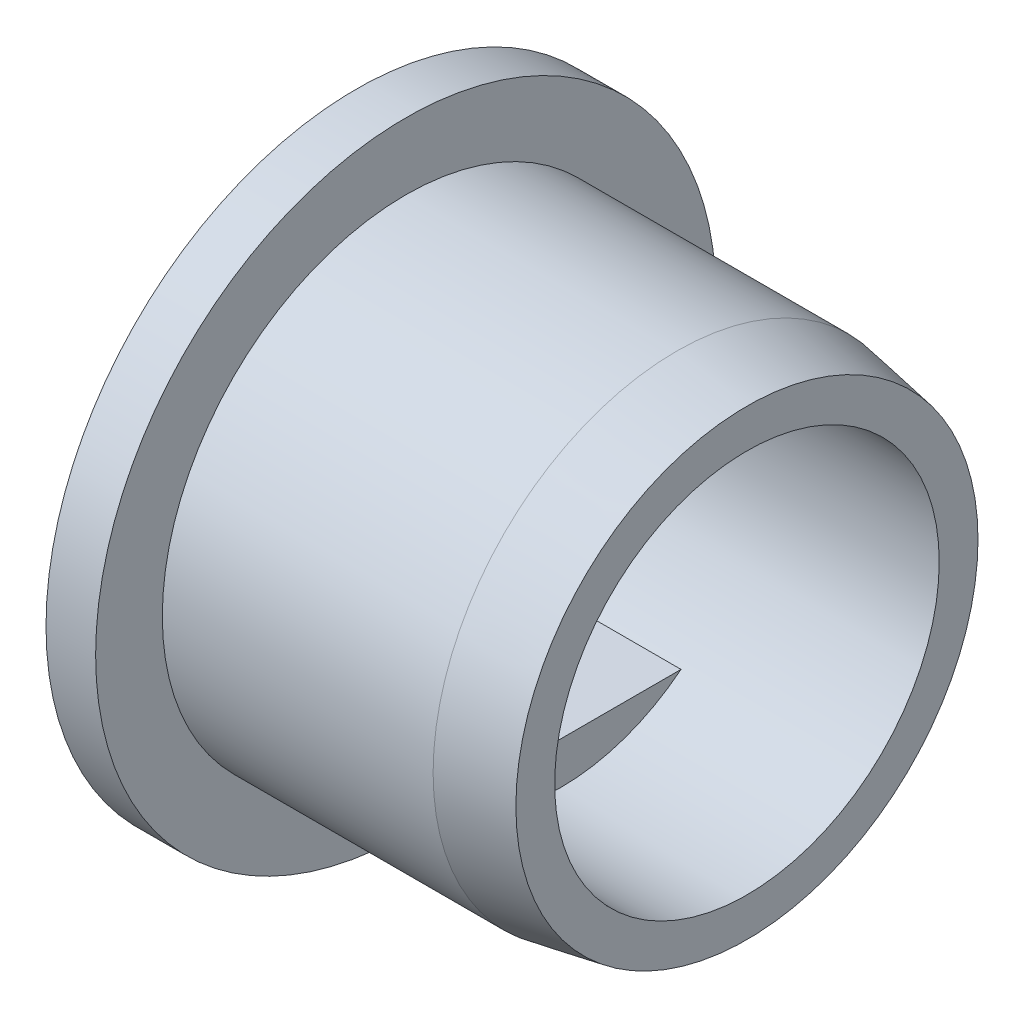
ISO-10303-21;
HEADER;
FILE_DESCRIPTION(('STEP AP214'),'2;1');
FILE_NAME('part.step','',(''),(''),'','','');
FILE_SCHEMA(('AUTOMOTIVE_DESIGN { 1 0 10303 214 1 1 1 1 }'));
ENDSEC;
DATA;
#1=APPLICATION_CONTEXT('core data for automotive mechanical design processes');
#2=APPLICATION_PROTOCOL_DEFINITION('international standard','automotive_design',2000,#1);
#3=PRODUCT_CONTEXT('',#1,'mechanical');
#4=PRODUCT('Part','Part','',(#3));
#5=PRODUCT_RELATED_PRODUCT_CATEGORY('part','',(#4));
#6=PRODUCT_DEFINITION_FORMATION('','',#4);
#7=PRODUCT_DEFINITION_CONTEXT('part definition',#1,'design');
#8=PRODUCT_DEFINITION('design','',#6,#7);
#9=PRODUCT_DEFINITION_SHAPE('','',#8);
#10=(LENGTH_UNIT() NAMED_UNIT(*) SI_UNIT(.MILLI.,.METRE.));
#11=(NAMED_UNIT(*) PLANE_ANGLE_UNIT() SI_UNIT($,.RADIAN.));
#12=(NAMED_UNIT(*) SI_UNIT($,.STERADIAN.) SOLID_ANGLE_UNIT());
#13=UNCERTAINTY_MEASURE_WITH_UNIT(LENGTH_MEASURE(1.E-05),#10,'distance_accuracy_value','');
#14=(GEOMETRIC_REPRESENTATION_CONTEXT(3) GLOBAL_UNCERTAINTY_ASSIGNED_CONTEXT((#13)) GLOBAL_UNIT_ASSIGNED_CONTEXT((#10,
#11,#12)) REPRESENTATION_CONTEXT('',''));
#15=CARTESIAN_POINT('',(0.,0.,0.));
#16=DIRECTION('',(0.,0.,1.));
#17=DIRECTION('',(1.,0.,0.));
#18=AXIS2_PLACEMENT_3D('',#15,#16,#17);
#19=CARTESIAN_POINT('',(150.8,0.,0.));
#20=DIRECTION('',(1.,0.,0.));
#21=DIRECTION('',(0.,0.,-1.));
#22=AXIS2_PLACEMENT_3D('',#19,#20,#21);
#23=PLANE('',#22);
#24=CARTESIAN_POINT('',(150.8,0.,0.));
#25=DIRECTION('',(1.,0.,0.));
#26=DIRECTION('',(0.,0.,-1.));
#27=AXIS2_PLACEMENT_3D('',#24,#25,#26);
#28=CIRCLE('',#27,3.925);
#29=CARTESIAN_POINT('',(150.8,0.,-3.925));
#30=VERTEX_POINT('',#29);
#31=EDGE_CURVE('E81',#30,#30,#28,.T.);
#32=ORIENTED_EDGE('',*,*,#31,.F.);
#33=EDGE_LOOP('',(#32));
#34=FACE_BOUND('',#33,.T.);
#35=CARTESIAN_POINT('',(150.8,0.,0.));
#36=DIRECTION('',(1.,0.,0.));
#37=DIRECTION('',(0.,0.,-1.));
#38=AXIS2_PLACEMENT_3D('',#35,#36,#37);
#39=CIRCLE('',#38,5.);
#40=CARTESIAN_POINT('',(150.8,0.,-5.));
#41=VERTEX_POINT('',#40);
#42=EDGE_CURVE('E132',#41,#41,#39,.T.);
#43=ORIENTED_EDGE('',*,*,#42,.T.);
#44=EDGE_LOOP('',(#43));
#45=FACE_BOUND('',#44,.T.);
#46=ADVANCED_FACE('F38',(#34,#45),#23,.T.);
#47=CARTESIAN_POINT('',(150.,0.,0.));
#48=DIRECTION('',(1.,0.,0.));
#49=DIRECTION('',(0.,0.,-1.));
#50=AXIS2_PLACEMENT_3D('',#47,#48,#49);
#51=PLANE('',#50);
#52=DIRECTION('',(0.,0.,-1.));
#53=VECTOR('',#52,1.);
#54=CARTESIAN_POINT('',(150.,-2.42,0.));
#55=LINE('',#54,#53);
#56=CARTESIAN_POINT('',(150.,-2.42,1.93742096612997));
#57=VERTEX_POINT('',#56);
#58=CARTESIAN_POINT('',(150.,-2.42,-1.93742096612997));
#59=VERTEX_POINT('',#58);
#60=EDGE_CURVE('E53',#57,#59,#55,.T.);
#61=ORIENTED_EDGE('',*,*,#60,.T.);
#62=CARTESIAN_POINT('',(150.,0.,0.));
#63=DIRECTION('',(1.,0.,0.));
#64=DIRECTION('',(0.,0.,-1.));
#65=AXIS2_PLACEMENT_3D('',#62,#63,#64);
#66=CIRCLE('',#65,3.1);
#67=EDGE_CURVE('E66',#57,#59,#66,.F.);
#68=ORIENTED_EDGE('',*,*,#67,.F.);
#69=EDGE_LOOP('',(#61,#68));
#70=FACE_BOUND('',#69,.T.);
#71=CARTESIAN_POINT('',(150.,0.,0.));
#72=DIRECTION('',(1.,0.,0.));
#73=DIRECTION('',(0.,0.,-1.));
#74=AXIS2_PLACEMENT_3D('',#71,#72,#73);
#75=CIRCLE('',#74,5.);
#76=CARTESIAN_POINT('',(150.,0.,-5.));
#77=VERTEX_POINT('',#76);
#78=EDGE_CURVE('E42',#77,#77,#75,.T.);
#79=ORIENTED_EDGE('',*,*,#78,.F.);
#80=EDGE_LOOP('',(#79));
#81=FACE_BOUND('',#80,.T.);
#82=ADVANCED_FACE('F67',(#70,#81),#51,.F.);
#83=CARTESIAN_POINT('',(136.3,-2.42,0.));
#84=DIRECTION('',(0.,1.,0.));
#85=DIRECTION('',(0.,0.,1.));
#86=AXIS2_PLACEMENT_3D('',#83,#84,#85);
#87=PLANE('',#86);
#88=ORIENTED_EDGE('',*,*,#60,.F.);
#89=DIRECTION('',(1.,0.,0.));
#90=VECTOR('',#89,1.);
#91=CARTESIAN_POINT('',(136.3,-2.42,1.93742096612997));
#92=LINE('',#91,#90);
#93=CARTESIAN_POINT('',(153.3,-2.42,1.93742096612997));
#94=VERTEX_POINT('',#93);
#95=EDGE_CURVE('E74',#57,#94,#92,.T.);
#96=ORIENTED_EDGE('',*,*,#95,.T.);
#97=DIRECTION('',(0.,0.,1.));
#98=VECTOR('',#97,1.);
#99=CARTESIAN_POINT('',(153.3,-2.42,0.));
#100=LINE('',#99,#98);
#101=CARTESIAN_POINT('',(153.3,-2.42,-1.93742096612997));
#102=VERTEX_POINT('',#101);
#103=EDGE_CURVE('E84',#102,#94,#100,.T.);
#104=ORIENTED_EDGE('',*,*,#103,.F.);
#105=DIRECTION('',(1.,0.,0.));
#106=VECTOR('',#105,1.);
#107=CARTESIAN_POINT('',(136.3,-2.42,-1.93742096612997));
#108=LINE('',#107,#106);
#109=EDGE_CURVE('E60',#59,#102,#108,.T.);
#110=ORIENTED_EDGE('',*,*,#109,.F.);
#111=EDGE_LOOP('',(#88,#96,#104,#110));
#112=FACE_BOUND('',#111,.T.);
#113=ADVANCED_FACE('F72',(#112),#87,.T.);
#114=CARTESIAN_POINT('',(153.3,0.,0.));
#115=DIRECTION('',(1.,0.,0.));
#116=DIRECTION('',(0.,0.,-1.));
#117=AXIS2_PLACEMENT_3D('',#114,#115,#116);
#118=PLANE('',#117);
#119=CARTESIAN_POINT('',(153.3,0.,0.));
#120=DIRECTION('',(1.,0.,0.));
#121=DIRECTION('',(0.,0.,-1.));
#122=AXIS2_PLACEMENT_3D('',#119,#120,#121);
#123=CIRCLE('',#122,3.1);
#124=EDGE_CURVE('E75',#94,#102,#123,.T.);
#125=ORIENTED_EDGE('',*,*,#124,.T.);
#126=ORIENTED_EDGE('',*,*,#103,.T.);
#127=EDGE_LOOP('',(#125,#126));
#128=FACE_BOUND('',#127,.T.);
#129=ADVANCED_FACE('F121',(#128),#118,.T.);
#130=CARTESIAN_POINT('',(136.3,0.,0.));
#131=DIRECTION('',(1.,0.,0.));
#132=DIRECTION('',(0.,0.,-1.));
#133=AXIS2_PLACEMENT_3D('',#130,#131,#132);
#134=CYLINDRICAL_SURFACE('',#133,3.1);
#135=CARTESIAN_POINT('',(156.3,0.,0.));
#136=DIRECTION('',(1.,0.,0.));
#137=DIRECTION('',(0.,0.,-1.));
#138=AXIS2_PLACEMENT_3D('',#135,#136,#137);
#139=CIRCLE('',#138,3.1);
#140=CARTESIAN_POINT('',(156.3,0.,-3.1));
#141=VERTEX_POINT('',#140);
#142=EDGE_CURVE('E79',#141,#141,#139,.T.);
#143=ORIENTED_EDGE('',*,*,#142,.T.);
#144=EDGE_LOOP('',(#143));
#145=FACE_BOUND('',#144,.T.);
#146=ORIENTED_EDGE('',*,*,#95,.F.);
#147=ORIENTED_EDGE('',*,*,#67,.T.);
#148=ORIENTED_EDGE('',*,*,#109,.T.);
#149=ORIENTED_EDGE('',*,*,#124,.F.);
#150=EDGE_LOOP('',(#146,#147,#148,#149));
#151=FACE_BOUND('',#150,.T.);
#152=ADVANCED_FACE('F77',(#145,#151),#134,.F.);
#153=CARTESIAN_POINT('',(156.3,0.,0.));
#154=DIRECTION('',(1.,0.,0.));
#155=DIRECTION('',(0.,0.,-1.));
#156=AXIS2_PLACEMENT_3D('',#153,#154,#155);
#157=PLANE('',#156);
#158=CARTESIAN_POINT('',(156.3,0.,0.));
#159=DIRECTION('',(1.,0.,0.));
#160=DIRECTION('',(0.,0.,-1.));
#161=AXIS2_PLACEMENT_3D('',#158,#159,#160);
#162=CIRCLE('',#161,3.725);
#163=CARTESIAN_POINT('',(156.3,0.,-3.725));
#164=VERTEX_POINT('',#163);
#165=EDGE_CURVE('E47',#164,#164,#162,.T.);
#166=ORIENTED_EDGE('',*,*,#165,.T.);
#167=EDGE_LOOP('',(#166));
#168=FACE_BOUND('',#167,.T.);
#169=ORIENTED_EDGE('',*,*,#142,.F.);
#170=EDGE_LOOP('',(#169));
#171=FACE_BOUND('',#170,.T.);
#172=ADVANCED_FACE('F92',(#168,#171),#157,.T.);
#173=CARTESIAN_POINT('',(156.3,0.,0.));
#174=DIRECTION('',(-1.,0.,0.));
#175=DIRECTION('',(0.,0.,1.));
#176=AXIS2_PLACEMENT_3D('',#173,#174,#175);
#177=CYLINDRICAL_SURFACE('',#176,3.925);
#178=CARTESIAN_POINT('',(155.165743636076,0.,0.));
#179=DIRECTION('',(1.,0.,0.));
#180=DIRECTION('',(0.,0.,-1.));
#181=AXIS2_PLACEMENT_3D('',#178,#179,#180);
#182=CIRCLE('',#181,3.925);
#183=CARTESIAN_POINT('',(155.165743636076,0.,-3.925));
#184=VERTEX_POINT('',#183);
#185=EDGE_CURVE('E12',#184,#184,#182,.F.);
#186=ORIENTED_EDGE('',*,*,#185,.T.);
#187=EDGE_LOOP('',(#186));
#188=FACE_BOUND('',#187,.T.);
#189=ORIENTED_EDGE('',*,*,#31,.T.);
#190=EDGE_LOOP('',(#189));
#191=FACE_BOUND('',#190,.T.);
#192=ADVANCED_FACE('F97',(#188,#191),#177,.T.);
#193=CARTESIAN_POINT('',(156.3,0.,0.));
#194=DIRECTION('',(-1.,0.,0.));
#195=DIRECTION('',(0.,0.,1.));
#196=AXIS2_PLACEMENT_3D('',#193,#194,#195);
#197=CONICAL_SURFACE('',#196,3.725,0.174532925199431);
#198=ORIENTED_EDGE('',*,*,#185,.F.);
#199=EDGE_LOOP('',(#198));
#200=FACE_BOUND('',#199,.T.);
#201=ORIENTED_EDGE('',*,*,#165,.F.);
#202=EDGE_LOOP('',(#201));
#203=FACE_BOUND('',#202,.T.);
#204=ADVANCED_FACE('F40',(#200,#203),#197,.T.);
#205=CARTESIAN_POINT('',(140.8,0.,0.));
#206=DIRECTION('',(1.,0.,0.));
#207=DIRECTION('',(0.,0.,-1.));
#208=AXIS2_PLACEMENT_3D('',#205,#206,#207);
#209=CYLINDRICAL_SURFACE('',#208,5.);
#210=ORIENTED_EDGE('',*,*,#42,.F.);
#211=EDGE_LOOP('',(#210));
#212=FACE_BOUND('',#211,.T.);
#213=ORIENTED_EDGE('',*,*,#78,.T.);
#214=EDGE_LOOP('',(#213));
#215=FACE_BOUND('',#214,.T.);
#216=ADVANCED_FACE('F96',(#212,#215),#209,.T.);
#217=CLOSED_SHELL('',(#46,#82,#113,#129,#152,#172,#192,#204,#216));
#218=MANIFOLD_SOLID_BREP('B2',#217);
#219=ADVANCED_BREP_SHAPE_REPRESENTATION('',(#18,#218),#14);
#220=SHAPE_DEFINITION_REPRESENTATION(#9,#219);
ENDSEC;
END-ISO-10303-21;
